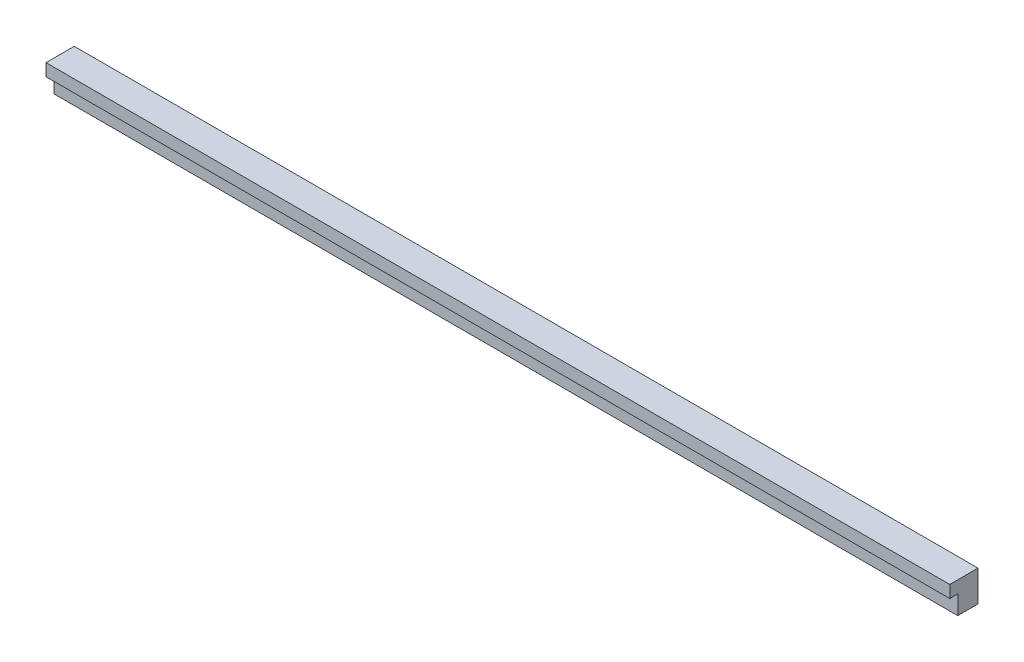
ISO-10303-21;
HEADER;
FILE_DESCRIPTION(('STEP AP214'),'2;1');
FILE_NAME('part.step','',(''),(''),'','','');
FILE_SCHEMA(('AUTOMOTIVE_DESIGN { 1 0 10303 214 1 1 1 1 }'));
ENDSEC;
DATA;
#1=APPLICATION_CONTEXT('core data for automotive mechanical design processes');
#2=APPLICATION_PROTOCOL_DEFINITION('international standard','automotive_design',2000,#1);
#3=PRODUCT_CONTEXT('',#1,'mechanical');
#4=PRODUCT('Part','Part','',(#3));
#5=PRODUCT_RELATED_PRODUCT_CATEGORY('part','',(#4));
#6=PRODUCT_DEFINITION_FORMATION('','',#4);
#7=PRODUCT_DEFINITION_CONTEXT('part definition',#1,'design');
#8=PRODUCT_DEFINITION('design','',#6,#7);
#9=PRODUCT_DEFINITION_SHAPE('','',#8);
#10=(LENGTH_UNIT() NAMED_UNIT(*) SI_UNIT(.MILLI.,.METRE.));
#11=(NAMED_UNIT(*) PLANE_ANGLE_UNIT() SI_UNIT($,.RADIAN.));
#12=(NAMED_UNIT(*) SI_UNIT($,.STERADIAN.) SOLID_ANGLE_UNIT());
#13=UNCERTAINTY_MEASURE_WITH_UNIT(LENGTH_MEASURE(1.E-05),#10,'distance_accuracy_value','');
#14=(GEOMETRIC_REPRESENTATION_CONTEXT(3) GLOBAL_UNCERTAINTY_ASSIGNED_CONTEXT((#13)) GLOBAL_UNIT_ASSIGNED_CONTEXT((#10,
#11,#12)) REPRESENTATION_CONTEXT('',''));
#15=CARTESIAN_POINT('',(0.,0.,0.));
#16=DIRECTION('',(0.,0.,1.));
#17=DIRECTION('',(1.,0.,0.));
#18=AXIS2_PLACEMENT_3D('',#15,#16,#17);
#19=CARTESIAN_POINT('',(581.,-2.79914980083618E-13,21.5000000000002));
#20=DIRECTION('',(0.,0.,-1.));
#21=DIRECTION('',(0.,1.,0.));
#22=AXIS2_PLACEMENT_3D('',#19,#20,#21);
#23=PLANE('',#22);
#24=DIRECTION('',(1.,0.,0.));
#25=VECTOR('',#24,1.);
#26=CARTESIAN_POINT('',(641.,182.,21.5000000000003));
#27=LINE('',#26,#25);
#28=CARTESIAN_POINT('',(-319.,182.,21.5000000000003));
#29=VERTEX_POINT('',#28);
#30=CARTESIAN_POINT('',(641.,182.,21.5000000000003));
#31=VERTEX_POINT('',#30);
#32=EDGE_CURVE('E50',#29,#31,#27,.T.);
#33=ORIENTED_EDGE('',*,*,#32,.F.);
#34=DIRECTION('',(0.,1.,0.));
#35=VECTOR('',#34,1.);
#36=CARTESIAN_POINT('',(-319.,194.999999999999,21.5000000000003));
#37=LINE('',#36,#35);
#38=CARTESIAN_POINT('',(-319.,162.,21.5000000000003));
#39=VERTEX_POINT('',#38);
#40=EDGE_CURVE('E11',#39,#29,#37,.T.);
#41=ORIENTED_EDGE('',*,*,#40,.F.);
#42=DIRECTION('',(-1.,0.,0.));
#43=VECTOR('',#42,1.);
#44=CARTESIAN_POINT('',(-319.,162.,21.5000000000003));
#45=LINE('',#44,#43);
#46=CARTESIAN_POINT('',(641.,162.,21.5000000000002));
#47=VERTEX_POINT('',#46);
#48=EDGE_CURVE('E42',#47,#39,#45,.T.);
#49=ORIENTED_EDGE('',*,*,#48,.F.);
#50=DIRECTION('',(0.,1.,0.));
#51=VECTOR('',#50,1.);
#52=CARTESIAN_POINT('',(641.,194.999999999999,21.5000000000002));
#53=LINE('',#52,#51);
#54=EDGE_CURVE('E82',#47,#31,#53,.T.);
#55=ORIENTED_EDGE('',*,*,#54,.T.);
#56=EDGE_LOOP('',(#33,#41,#49,#55));
#57=FACE_BOUND('',#56,.T.);
#58=ADVANCED_FACE('F33',(#57),#23,.F.);
#59=CARTESIAN_POINT('',(-319.,195.,982.067020045973));
#60=DIRECTION('',(1.,0.,0.));
#61=DIRECTION('',(0.,0.,-1.));
#62=AXIS2_PLACEMENT_3D('',#59,#60,#61);
#63=PLANE('',#62);
#64=DIRECTION('',(0.,0.,-1.));
#65=VECTOR('',#64,1.);
#66=CARTESIAN_POINT('',(-319.,162.,982.067020045973));
#67=LINE('',#66,#65);
#68=CARTESIAN_POINT('',(-319.,162.,0.));
#69=VERTEX_POINT('',#68);
#70=EDGE_CURVE('E37',#39,#69,#67,.T.);
#71=ORIENTED_EDGE('',*,*,#70,.F.);
#72=ORIENTED_EDGE('',*,*,#40,.T.);
#73=DIRECTION('',(0.,0.,-1.));
#74=VECTOR('',#73,1.);
#75=CARTESIAN_POINT('',(-319.,182.,990.08801679846));
#76=LINE('',#75,#74);
#77=CARTESIAN_POINT('',(-319.,182.,30.0000000000005));
#78=VERTEX_POINT('',#77);
#79=EDGE_CURVE('E95',#78,#29,#76,.T.);
#80=ORIENTED_EDGE('',*,*,#79,.F.);
#81=DIRECTION('',(0.,1.,0.));
#82=VECTOR('',#81,1.);
#83=CARTESIAN_POINT('',(-319.,194.999999999999,30.0000000000004));
#84=LINE('',#83,#82);
#85=CARTESIAN_POINT('',(-319.,195.,30.0000000000004));
#86=VERTEX_POINT('',#85);
#87=EDGE_CURVE('E106',#78,#86,#84,.T.);
#88=ORIENTED_EDGE('',*,*,#87,.T.);
#89=DIRECTION('',(0.,0.,-1.));
#90=VECTOR('',#89,1.);
#91=CARTESIAN_POINT('',(-319.,195.,982.067020045973));
#92=LINE('',#91,#90);
#93=CARTESIAN_POINT('',(-319.,195.,0.));
#94=VERTEX_POINT('',#93);
#95=EDGE_CURVE('E121',#86,#94,#92,.T.);
#96=ORIENTED_EDGE('',*,*,#95,.T.);
#97=DIRECTION('',(0.,-1.,0.));
#98=VECTOR('',#97,1.);
#99=CARTESIAN_POINT('',(-319.,195.,0.));
#100=LINE('',#99,#98);
#101=EDGE_CURVE('E109',#94,#69,#100,.T.);
#102=ORIENTED_EDGE('',*,*,#101,.T.);
#103=EDGE_LOOP('',(#71,#72,#80,#88,#96,#102));
#104=FACE_BOUND('',#103,.T.);
#105=ADVANCED_FACE('F35',(#104),#63,.F.);
#106=CARTESIAN_POINT('',(-319.,162.,982.067020045973));
#107=DIRECTION('',(0.,1.,0.));
#108=DIRECTION('',(0.,0.,1.));
#109=AXIS2_PLACEMENT_3D('',#106,#107,#108);
#110=PLANE('',#109);
#111=DIRECTION('',(0.,0.,-1.));
#112=VECTOR('',#111,1.);
#113=CARTESIAN_POINT('',(641.,162.,982.067020045973));
#114=LINE('',#113,#112);
#115=CARTESIAN_POINT('',(641.,162.,0.));
#116=VERTEX_POINT('',#115);
#117=EDGE_CURVE('E124',#47,#116,#114,.T.);
#118=ORIENTED_EDGE('',*,*,#117,.F.);
#119=ORIENTED_EDGE('',*,*,#48,.T.);
#120=ORIENTED_EDGE('',*,*,#70,.T.);
#121=DIRECTION('',(1.,0.,0.));
#122=VECTOR('',#121,1.);
#123=CARTESIAN_POINT('',(-319.,162.,0.));
#124=LINE('',#123,#122);
#125=EDGE_CURVE('E112',#69,#116,#124,.T.);
#126=ORIENTED_EDGE('',*,*,#125,.T.);
#127=EDGE_LOOP('',(#118,#119,#120,#126));
#128=FACE_BOUND('',#127,.T.);
#129=ADVANCED_FACE('F129',(#128),#110,.F.);
#130=CARTESIAN_POINT('',(641.,195.,982.067020045973));
#131=DIRECTION('',(1.,0.,0.));
#132=DIRECTION('',(0.,0.,-1.));
#133=AXIS2_PLACEMENT_3D('',#130,#131,#132);
#134=PLANE('',#133);
#135=ORIENTED_EDGE('',*,*,#54,.F.);
#136=ORIENTED_EDGE('',*,*,#117,.T.);
#137=DIRECTION('',(0.,-1.,0.));
#138=VECTOR('',#137,1.);
#139=CARTESIAN_POINT('',(641.,195.,0.));
#140=LINE('',#139,#138);
#141=CARTESIAN_POINT('',(641.,195.,0.));
#142=VERTEX_POINT('',#141);
#143=EDGE_CURVE('E115',#142,#116,#140,.T.);
#144=ORIENTED_EDGE('',*,*,#143,.F.);
#145=DIRECTION('',(0.,0.,-1.));
#146=VECTOR('',#145,1.);
#147=CARTESIAN_POINT('',(641.,195.,982.067020045973));
#148=LINE('',#147,#146);
#149=CARTESIAN_POINT('',(641.,195.,30.0000000000002));
#150=VERTEX_POINT('',#149);
#151=EDGE_CURVE('E123',#150,#142,#148,.T.);
#152=ORIENTED_EDGE('',*,*,#151,.F.);
#153=DIRECTION('',(0.,-1.,0.));
#154=VECTOR('',#153,1.);
#155=CARTESIAN_POINT('',(641.,194.999999999999,30.0000000000002));
#156=LINE('',#155,#154);
#157=CARTESIAN_POINT('',(641.,182.,30.0000000000002));
#158=VERTEX_POINT('',#157);
#159=EDGE_CURVE('E92',#150,#158,#156,.T.);
#160=ORIENTED_EDGE('',*,*,#159,.T.);
#161=DIRECTION('',(0.,0.,-1.));
#162=VECTOR('',#161,1.);
#163=CARTESIAN_POINT('',(641.,182.,990.08801679846));
#164=LINE('',#163,#162);
#165=EDGE_CURVE('E89',#158,#31,#164,.T.);
#166=ORIENTED_EDGE('',*,*,#165,.T.);
#167=EDGE_LOOP('',(#135,#136,#144,#152,#160,#166));
#168=FACE_BOUND('',#167,.T.);
#169=ADVANCED_FACE('F90',(#168),#134,.T.);
#170=CARTESIAN_POINT('',(-319.,195.,982.067020045973));
#171=DIRECTION('',(0.,1.,0.));
#172=DIRECTION('',(0.,0.,1.));
#173=AXIS2_PLACEMENT_3D('',#170,#171,#172);
#174=PLANE('',#173);
#175=ORIENTED_EDGE('',*,*,#95,.F.);
#176=DIRECTION('',(1.,0.,0.));
#177=VECTOR('',#176,1.);
#178=CARTESIAN_POINT('',(640.999999999999,195.,30.0000000000002));
#179=LINE('',#178,#177);
#180=EDGE_CURVE('E140',#86,#150,#179,.T.);
#181=ORIENTED_EDGE('',*,*,#180,.T.);
#182=ORIENTED_EDGE('',*,*,#151,.T.);
#183=DIRECTION('',(1.,0.,0.));
#184=VECTOR('',#183,1.);
#185=CARTESIAN_POINT('',(-319.,195.,0.));
#186=LINE('',#185,#184);
#187=EDGE_CURVE('E118',#94,#142,#186,.T.);
#188=ORIENTED_EDGE('',*,*,#187,.F.);
#189=EDGE_LOOP('',(#175,#181,#182,#188));
#190=FACE_BOUND('',#189,.T.);
#191=ADVANCED_FACE('F139',(#190),#174,.T.);
#192=CARTESIAN_POINT('',(0.,0.,0.));
#193=DIRECTION('',(0.,0.,1.));
#194=DIRECTION('',(1.,0.,0.));
#195=AXIS2_PLACEMENT_3D('',#192,#193,#194);
#196=PLANE('',#195);
#197=ORIENTED_EDGE('',*,*,#101,.F.);
#198=ORIENTED_EDGE('',*,*,#187,.T.);
#199=ORIENTED_EDGE('',*,*,#143,.T.);
#200=ORIENTED_EDGE('',*,*,#125,.F.);
#201=EDGE_LOOP('',(#197,#198,#199,#200));
#202=FACE_BOUND('',#201,.T.);
#203=ADVANCED_FACE('F133',(#202),#196,.F.);
#204=CARTESIAN_POINT('',(641.,182.,990.08801679846));
#205=DIRECTION('',(0.,1.,0.));
#206=DIRECTION('',(0.,0.,1.));
#207=AXIS2_PLACEMENT_3D('',#204,#205,#206);
#208=PLANE('',#207);
#209=ORIENTED_EDGE('',*,*,#165,.F.);
#210=DIRECTION('',(-1.,0.,0.));
#211=VECTOR('',#210,1.);
#212=CARTESIAN_POINT('',(640.999999999999,182.,30.0000000000002));
#213=LINE('',#212,#211);
#214=EDGE_CURVE('E105',#158,#78,#213,.T.);
#215=ORIENTED_EDGE('',*,*,#214,.T.);
#216=ORIENTED_EDGE('',*,*,#79,.T.);
#217=ORIENTED_EDGE('',*,*,#32,.T.);
#218=EDGE_LOOP('',(#209,#215,#216,#217));
#219=FACE_BOUND('',#218,.T.);
#220=ADVANCED_FACE('F98',(#219),#208,.F.);
#221=CARTESIAN_POINT('',(-259.,-2.77555756156289E-13,30.0000000000003));
#222=DIRECTION('',(0.,0.,-1.));
#223=DIRECTION('',(0.,1.,0.));
#224=AXIS2_PLACEMENT_3D('',#221,#222,#223);
#225=PLANE('',#224);
#226=ORIENTED_EDGE('',*,*,#180,.F.);
#227=ORIENTED_EDGE('',*,*,#87,.F.);
#228=ORIENTED_EDGE('',*,*,#214,.F.);
#229=ORIENTED_EDGE('',*,*,#159,.F.);
#230=EDGE_LOOP('',(#226,#227,#228,#229));
#231=FACE_BOUND('',#230,.T.);
#232=ADVANCED_FACE('F142',(#231),#225,.F.);
#233=CLOSED_SHELL('',(#58,#105,#129,#169,#191,#203,#220,#232));
#234=MANIFOLD_SOLID_BREP('B2',#233);
#235=ADVANCED_BREP_SHAPE_REPRESENTATION('',(#18,#234),#14);
#236=SHAPE_DEFINITION_REPRESENTATION(#9,#235);
ENDSEC;
END-ISO-10303-21;
